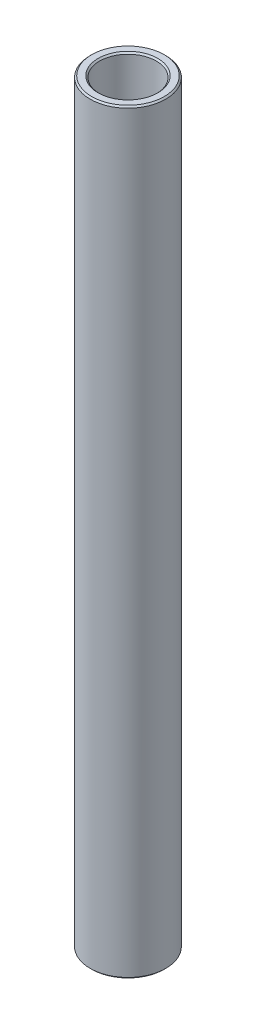
ISO-10303-21;
HEADER;
FILE_DESCRIPTION(('STEP AP214'),'2;1');
FILE_NAME('part.step','',(''),(''),'','','');
FILE_SCHEMA(('AUTOMOTIVE_DESIGN { 1 0 10303 214 1 1 1 1 }'));
ENDSEC;
DATA;
#1=APPLICATION_CONTEXT('core data for automotive mechanical design processes');
#2=APPLICATION_PROTOCOL_DEFINITION('international standard','automotive_design',2000,#1);
#3=PRODUCT_CONTEXT('',#1,'mechanical');
#4=PRODUCT('Part','Part','',(#3));
#5=PRODUCT_RELATED_PRODUCT_CATEGORY('part','',(#4));
#6=PRODUCT_DEFINITION_FORMATION('','',#4);
#7=PRODUCT_DEFINITION_CONTEXT('part definition',#1,'design');
#8=PRODUCT_DEFINITION('design','',#6,#7);
#9=PRODUCT_DEFINITION_SHAPE('','',#8);
#10=(LENGTH_UNIT() NAMED_UNIT(*) SI_UNIT(.MILLI.,.METRE.));
#11=(NAMED_UNIT(*) PLANE_ANGLE_UNIT() SI_UNIT($,.RADIAN.));
#12=(NAMED_UNIT(*) SI_UNIT($,.STERADIAN.) SOLID_ANGLE_UNIT());
#13=UNCERTAINTY_MEASURE_WITH_UNIT(LENGTH_MEASURE(1.E-05),#10,'distance_accuracy_value','');
#14=(GEOMETRIC_REPRESENTATION_CONTEXT(3) GLOBAL_UNCERTAINTY_ASSIGNED_CONTEXT((#13)) GLOBAL_UNIT_ASSIGNED_CONTEXT((#10,
#11,#12)) REPRESENTATION_CONTEXT('',''));
#15=CARTESIAN_POINT('',(0.,0.,0.));
#16=DIRECTION('',(0.,0.,1.));
#17=DIRECTION('',(1.,0.,0.));
#18=AXIS2_PLACEMENT_3D('',#15,#16,#17);
#19=CARTESIAN_POINT('',(0.,11.60859375,0.));
#20=DIRECTION('',(0.,1.,0.));
#21=DIRECTION('',(-1.,0.,0.));
#22=AXIS2_PLACEMENT_3D('',#19,#20,#21);
#23=CYLINDRICAL_SURFACE('',#22,4.76250000000001);
#24=CARTESIAN_POINT('',(0.,-63.246,0.));
#25=DIRECTION('',(0.,1.,0.));
#26=DIRECTION('',(-1.,0.,0.));
#27=AXIS2_PLACEMENT_3D('',#24,#25,#26);
#28=CIRCLE('',#27,4.76250000000001);
#29=CARTESIAN_POINT('',(-4.76250000000002,-63.246,0.));
#30=VERTEX_POINT('',#29);
#31=EDGE_CURVE('E51',#30,#30,#28,.F.);
#32=ORIENTED_EDGE('',*,*,#31,.T.);
#33=EDGE_LOOP('',(#32));
#34=FACE_BOUND('',#33,.T.);
#35=CARTESIAN_POINT('',(0.,63.246,0.));
#36=DIRECTION('',(0.,-1.,0.));
#37=DIRECTION('',(1.,0.,0.));
#38=AXIS2_PLACEMENT_3D('',#35,#36,#37);
#39=CIRCLE('',#38,4.76250000000001);
#40=CARTESIAN_POINT('',(4.76250000000002,63.246,0.));
#41=VERTEX_POINT('',#40);
#42=EDGE_CURVE('E54',#41,#41,#39,.F.);
#43=ORIENTED_EDGE('',*,*,#42,.T.);
#44=EDGE_LOOP('',(#43));
#45=FACE_BOUND('',#44,.T.);
#46=ADVANCED_FACE('F31',(#34,#45),#23,.F.);
#47=CARTESIAN_POINT('',(4.76250000000001,63.5,0.));
#48=DIRECTION('',(0.,-1.,0.));
#49=DIRECTION('',(1.,0.,0.));
#50=AXIS2_PLACEMENT_3D('',#47,#48,#49);
#51=PLANE('',#50);
#52=CARTESIAN_POINT('',(0.,63.5,0.));
#53=DIRECTION('',(0.,-1.,0.));
#54=DIRECTION('',(1.,0.,0.));
#55=AXIS2_PLACEMENT_3D('',#52,#53,#54);
#56=CIRCLE('',#55,6.09599999999997);
#57=CARTESIAN_POINT('',(6.09599999999998,63.5,0.));
#58=VERTEX_POINT('',#57);
#59=EDGE_CURVE('E10',#58,#58,#56,.F.);
#60=ORIENTED_EDGE('',*,*,#59,.T.);
#61=EDGE_LOOP('',(#60));
#62=FACE_BOUND('',#61,.T.);
#63=CARTESIAN_POINT('',(0.,63.5,0.));
#64=DIRECTION('',(0.,-1.,0.));
#65=DIRECTION('',(1.,0.,0.));
#66=AXIS2_PLACEMENT_3D('',#63,#64,#65);
#67=CIRCLE('',#66,5.01650000000005);
#68=CARTESIAN_POINT('',(5.01650000000006,63.5,0.));
#69=VERTEX_POINT('',#68);
#70=EDGE_CURVE('E38',#69,#69,#67,.T.);
#71=ORIENTED_EDGE('',*,*,#70,.T.);
#72=EDGE_LOOP('',(#71));
#73=FACE_BOUND('',#72,.T.);
#74=ADVANCED_FACE('F77',(#62,#73),#51,.F.);
#75=CARTESIAN_POINT('',(0.,11.60859375,0.));
#76=DIRECTION('',(0.,1.,0.));
#77=DIRECTION('',(-1.,0.,0.));
#78=AXIS2_PLACEMENT_3D('',#75,#76,#77);
#79=CYLINDRICAL_SURFACE('',#78,6.35);
#80=CARTESIAN_POINT('',(0.,-63.246,0.));
#81=DIRECTION('',(0.,1.,0.));
#82=DIRECTION('',(-1.,0.,0.));
#83=AXIS2_PLACEMENT_3D('',#80,#81,#82);
#84=CIRCLE('',#83,6.35);
#85=CARTESIAN_POINT('',(-6.35,-63.246,0.));
#86=VERTEX_POINT('',#85);
#87=EDGE_CURVE('E42',#86,#86,#84,.T.);
#88=ORIENTED_EDGE('',*,*,#87,.T.);
#89=EDGE_LOOP('',(#88));
#90=FACE_BOUND('',#89,.T.);
#91=CARTESIAN_POINT('',(0.,63.246,0.));
#92=DIRECTION('',(0.,-1.,0.));
#93=DIRECTION('',(1.,0.,0.));
#94=AXIS2_PLACEMENT_3D('',#91,#92,#93);
#95=CIRCLE('',#94,6.35);
#96=CARTESIAN_POINT('',(6.35000000000001,63.246,0.));
#97=VERTEX_POINT('',#96);
#98=EDGE_CURVE('E46',#97,#97,#95,.T.);
#99=ORIENTED_EDGE('',*,*,#98,.T.);
#100=EDGE_LOOP('',(#99));
#101=FACE_BOUND('',#100,.T.);
#102=ADVANCED_FACE('F74',(#90,#101),#79,.T.);
#103=CARTESIAN_POINT('',(6.35000000000001,-63.5,0.));
#104=DIRECTION('',(0.,1.,0.));
#105=DIRECTION('',(-1.,0.,0.));
#106=AXIS2_PLACEMENT_3D('',#103,#104,#105);
#107=PLANE('',#106);
#108=CARTESIAN_POINT('',(0.,-63.5,0.));
#109=DIRECTION('',(0.,1.,0.));
#110=DIRECTION('',(-1.,0.,0.));
#111=AXIS2_PLACEMENT_3D('',#108,#109,#110);
#112=CIRCLE('',#111,5.01650000000002);
#113=CARTESIAN_POINT('',(-5.01650000000003,-63.5,0.));
#114=VERTEX_POINT('',#113);
#115=EDGE_CURVE('E57',#114,#114,#112,.T.);
#116=ORIENTED_EDGE('',*,*,#115,.T.);
#117=EDGE_LOOP('',(#116));
#118=FACE_BOUND('',#117,.T.);
#119=CARTESIAN_POINT('',(0.,-63.5,0.));
#120=DIRECTION('',(0.,1.,0.));
#121=DIRECTION('',(-1.,0.,0.));
#122=AXIS2_PLACEMENT_3D('',#119,#120,#121);
#123=CIRCLE('',#122,6.09599999999998);
#124=CARTESIAN_POINT('',(-6.09599999999998,-63.5,0.));
#125=VERTEX_POINT('',#124);
#126=EDGE_CURVE('E60',#125,#125,#123,.F.);
#127=ORIENTED_EDGE('',*,*,#126,.T.);
#128=EDGE_LOOP('',(#127));
#129=FACE_BOUND('',#128,.T.);
#130=ADVANCED_FACE('F64',(#118,#129),#107,.F.);
#131=CARTESIAN_POINT('',(0.,-63.5,0.));
#132=DIRECTION('',(0.,-1.,0.));
#133=DIRECTION('',(1.,0.,0.));
#134=AXIS2_PLACEMENT_3D('',#131,#132,#133);
#135=CONICAL_SURFACE('',#134,5.01650000000002,0.785398163397455);
#136=ORIENTED_EDGE('',*,*,#31,.F.);
#137=EDGE_LOOP('',(#136));
#138=FACE_BOUND('',#137,.T.);
#139=ORIENTED_EDGE('',*,*,#115,.F.);
#140=EDGE_LOOP('',(#139));
#141=FACE_BOUND('',#140,.T.);
#142=ADVANCED_FACE('F70',(#138,#141),#135,.F.);
#143=CARTESIAN_POINT('',(0.,-63.246,0.));
#144=DIRECTION('',(0.,1.,0.));
#145=DIRECTION('',(-1.,0.,0.));
#146=AXIS2_PLACEMENT_3D('',#143,#144,#145);
#147=CONICAL_SURFACE('',#146,6.35,0.785398163397431);
#148=ORIENTED_EDGE('',*,*,#126,.F.);
#149=EDGE_LOOP('',(#148));
#150=FACE_BOUND('',#149,.T.);
#151=ORIENTED_EDGE('',*,*,#87,.F.);
#152=EDGE_LOOP('',(#151));
#153=FACE_BOUND('',#152,.T.);
#154=ADVANCED_FACE('F66',(#150,#153),#147,.T.);
#155=CARTESIAN_POINT('',(0.,63.5,0.));
#156=DIRECTION('',(0.,-1.,0.));
#157=DIRECTION('',(1.,0.,0.));
#158=AXIS2_PLACEMENT_3D('',#155,#156,#157);
#159=CONICAL_SURFACE('',#158,6.09599999999998,0.785398163397458);
#160=ORIENTED_EDGE('',*,*,#98,.F.);
#161=EDGE_LOOP('',(#160));
#162=FACE_BOUND('',#161,.T.);
#163=ORIENTED_EDGE('',*,*,#59,.F.);
#164=EDGE_LOOP('',(#163));
#165=FACE_BOUND('',#164,.T.);
#166=ADVANCED_FACE('F69',(#162,#165),#159,.T.);
#167=CARTESIAN_POINT('',(0.,63.246,0.));
#168=DIRECTION('',(0.,1.,0.));
#169=DIRECTION('',(-1.,0.,0.));
#170=AXIS2_PLACEMENT_3D('',#167,#168,#169);
#171=CONICAL_SURFACE('',#170,4.76250000000001,0.785398163397455);
#172=ORIENTED_EDGE('',*,*,#70,.F.);
#173=EDGE_LOOP('',(#172));
#174=FACE_BOUND('',#173,.T.);
#175=ORIENTED_EDGE('',*,*,#42,.F.);
#176=EDGE_LOOP('',(#175));
#177=FACE_BOUND('',#176,.T.);
#178=ADVANCED_FACE('F33',(#174,#177),#171,.F.);
#179=CLOSED_SHELL('',(#46,#74,#102,#130,#142,#154,#166,#178));
#180=MANIFOLD_SOLID_BREP('B2',#179);
#181=ADVANCED_BREP_SHAPE_REPRESENTATION('',(#18,#180),#14);
#182=SHAPE_DEFINITION_REPRESENTATION(#9,#181);
ENDSEC;
END-ISO-10303-21;
